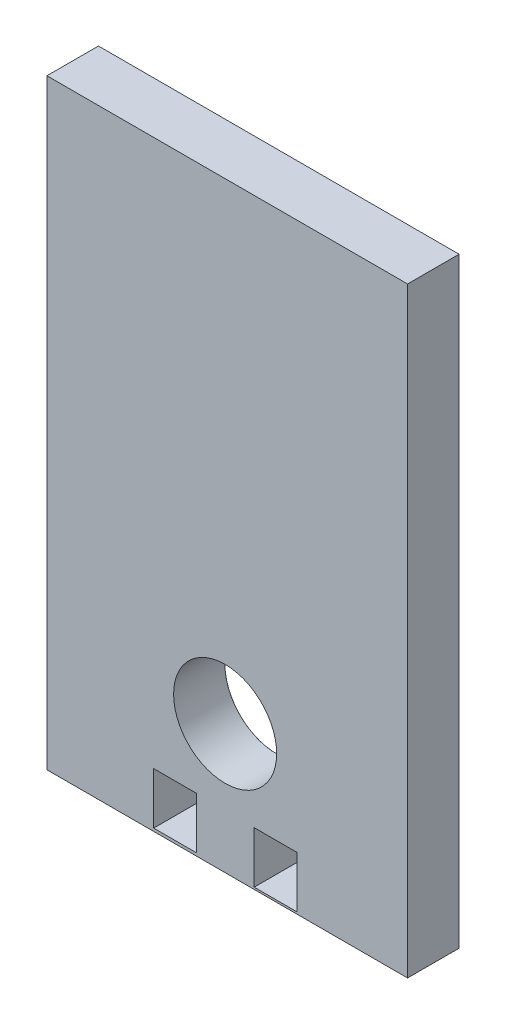
ISO-10303-21;
HEADER;
FILE_DESCRIPTION(('STEP AP214'),'2;1');
FILE_NAME('part.step','',(''),(''),'','','');
FILE_SCHEMA(('AUTOMOTIVE_DESIGN { 1 0 10303 214 1 1 1 1 }'));
ENDSEC;
DATA;
#1=APPLICATION_CONTEXT('core data for automotive mechanical design processes');
#2=APPLICATION_PROTOCOL_DEFINITION('international standard','automotive_design',2000,#1);
#3=PRODUCT_CONTEXT('',#1,'mechanical');
#4=PRODUCT('Part','Part','',(#3));
#5=PRODUCT_RELATED_PRODUCT_CATEGORY('part','',(#4));
#6=PRODUCT_DEFINITION_FORMATION('','',#4);
#7=PRODUCT_DEFINITION_CONTEXT('part definition',#1,'design');
#8=PRODUCT_DEFINITION('design','',#6,#7);
#9=PRODUCT_DEFINITION_SHAPE('','',#8);
#10=(LENGTH_UNIT() NAMED_UNIT(*) SI_UNIT(.MILLI.,.METRE.));
#11=(NAMED_UNIT(*) PLANE_ANGLE_UNIT() SI_UNIT($,.RADIAN.));
#12=(NAMED_UNIT(*) SI_UNIT($,.STERADIAN.) SOLID_ANGLE_UNIT());
#13=UNCERTAINTY_MEASURE_WITH_UNIT(LENGTH_MEASURE(1.E-05),#10,'distance_accuracy_value','');
#14=(GEOMETRIC_REPRESENTATION_CONTEXT(3) GLOBAL_UNCERTAINTY_ASSIGNED_CONTEXT((#13)) GLOBAL_UNIT_ASSIGNED_CONTEXT((#10,
#11,#12)) REPRESENTATION_CONTEXT('',''));
#15=CARTESIAN_POINT('',(0.,0.,0.));
#16=DIRECTION('',(0.,0.,1.));
#17=DIRECTION('',(1.,0.,0.));
#18=AXIS2_PLACEMENT_3D('',#15,#16,#17);
#19=CARTESIAN_POINT('',(0.,0.,6.));
#20=DIRECTION('',(0.,0.,1.));
#21=DIRECTION('',(1.,0.,0.));
#22=AXIS2_PLACEMENT_3D('',#19,#20,#21);
#23=PLANE('',#22);
#24=CARTESIAN_POINT('',(-10.0965774261562,49.8984340550313,6.));
#25=DIRECTION('',(0.,0.,1.));
#26=DIRECTION('',(1.,0.,0.));
#27=AXIS2_PLACEMENT_3D('',#24,#25,#26);
#28=CIRCLE('',#27,5.99999999999999);
#29=CARTESIAN_POINT('',(-4.09657742615621,49.8984340550313,6.));
#30=VERTEX_POINT('',#29);
#31=EDGE_CURVE('E42',#30,#30,#28,.T.);
#32=ORIENTED_EDGE('',*,*,#31,.F.);
#33=EDGE_LOOP('',(#32));
#34=FACE_BOUND('',#33,.T.);
#35=DIRECTION('',(0.,1.,0.));
#36=VECTOR('',#35,1.);
#37=CARTESIAN_POINT('',(11.1502226827763,104.889242878561,6.));
#38=LINE('',#37,#36);
#39=CARTESIAN_POINT('',(11.1502226827763,34.8892428785607,6.));
#40=VERTEX_POINT('',#39);
#41=CARTESIAN_POINT('',(11.1502226827763,104.889242878561,6.));
#42=VERTEX_POINT('',#41);
#43=EDGE_CURVE('E230',#40,#42,#38,.T.);
#44=ORIENTED_EDGE('',*,*,#43,.T.);
#45=DIRECTION('',(-1.,0.,0.));
#46=VECTOR('',#45,1.);
#47=CARTESIAN_POINT('',(-30.8497773172237,104.889242878561,6.));
#48=LINE('',#47,#46);
#49=CARTESIAN_POINT('',(-30.8497773172237,104.889242878561,6.));
#50=VERTEX_POINT('',#49);
#51=EDGE_CURVE('E234',#42,#50,#48,.T.);
#52=ORIENTED_EDGE('',*,*,#51,.T.);
#53=DIRECTION('',(0.,-1.,0.));
#54=VECTOR('',#53,1.);
#55=CARTESIAN_POINT('',(-30.8497773172237,104.889242878561,6.));
#56=LINE('',#55,#54);
#57=CARTESIAN_POINT('',(-30.8497773172237,34.8892428785607,6.));
#58=VERTEX_POINT('',#57);
#59=EDGE_CURVE('E238',#50,#58,#56,.T.);
#60=ORIENTED_EDGE('',*,*,#59,.T.);
#61=DIRECTION('',(1.,0.,0.));
#62=VECTOR('',#61,1.);
#63=CARTESIAN_POINT('',(-30.8497773172237,34.8892428785607,6.));
#64=LINE('',#63,#62);
#65=EDGE_CURVE('E241',#58,#40,#64,.T.);
#66=ORIENTED_EDGE('',*,*,#65,.T.);
#67=EDGE_LOOP('',(#44,#52,#60,#66));
#68=FACE_BOUND('',#67,.T.);
#69=DIRECTION('',(0.,-1.,0.));
#70=VECTOR('',#69,1.);
#71=CARTESIAN_POINT('',(-13.4136289198447,0.,6.));
#72=LINE('',#71,#70);
#73=CARTESIAN_POINT('',(-13.4136289198447,41.2243844001389,6.));
#74=VERTEX_POINT('',#73);
#75=CARTESIAN_POINT('',(-13.4136289198447,35.2243844001389,6.));
#76=VERTEX_POINT('',#75);
#77=EDGE_CURVE('E208',#74,#76,#72,.T.);
#78=ORIENTED_EDGE('',*,*,#77,.T.);
#79=DIRECTION('',(-1.,0.,0.));
#80=VECTOR('',#79,1.);
#81=CARTESIAN_POINT('',(0.,35.2243844001389,6.));
#82=LINE('',#81,#80);
#83=CARTESIAN_POINT('',(-18.4136289198447,35.2243844001389,6.));
#84=VERTEX_POINT('',#83);
#85=EDGE_CURVE('E212',#76,#84,#82,.T.);
#86=ORIENTED_EDGE('',*,*,#85,.T.);
#87=DIRECTION('',(0.,1.,0.));
#88=VECTOR('',#87,1.);
#89=CARTESIAN_POINT('',(-18.4136289198447,0.,6.));
#90=LINE('',#89,#88);
#91=CARTESIAN_POINT('',(-18.4136289198447,41.2243844001389,6.));
#92=VERTEX_POINT('',#91);
#93=EDGE_CURVE('E140',#84,#92,#90,.T.);
#94=ORIENTED_EDGE('',*,*,#93,.T.);
#95=DIRECTION('',(1.,0.,0.));
#96=VECTOR('',#95,1.);
#97=CARTESIAN_POINT('',(0.,41.2243844001389,6.));
#98=LINE('',#97,#96);
#99=EDGE_CURVE('E204',#92,#74,#98,.T.);
#100=ORIENTED_EDGE('',*,*,#99,.T.);
#101=EDGE_LOOP('',(#78,#86,#94,#100));
#102=FACE_BOUND('',#101,.T.);
#103=DIRECTION('',(0.,-1.,0.));
#104=VECTOR('',#103,1.);
#105=CARTESIAN_POINT('',(-1.71130173530675,0.,6.));
#106=LINE('',#105,#104);
#107=CARTESIAN_POINT('',(-1.71130173530675,41.1205277137011,6.));
#108=VERTEX_POINT('',#107);
#109=CARTESIAN_POINT('',(-1.71130173530675,35.1205277137011,6.));
#110=VERTEX_POINT('',#109);
#111=EDGE_CURVE('E224',#108,#110,#106,.T.);
#112=ORIENTED_EDGE('',*,*,#111,.T.);
#113=DIRECTION('',(-1.,0.,0.));
#114=VECTOR('',#113,1.);
#115=CARTESIAN_POINT('',(0.,35.1205277137011,6.));
#116=LINE('',#115,#114);
#117=CARTESIAN_POINT('',(-6.71130173530675,35.1205277137011,6.));
#118=VERTEX_POINT('',#117);
#119=EDGE_CURVE('E136',#110,#118,#116,.T.);
#120=ORIENTED_EDGE('',*,*,#119,.T.);
#121=DIRECTION('',(0.,1.,0.));
#122=VECTOR('',#121,1.);
#123=CARTESIAN_POINT('',(-6.71130173530675,0.,6.));
#124=LINE('',#123,#122);
#125=CARTESIAN_POINT('',(-6.71130173530675,41.1205277137011,6.));
#126=VERTEX_POINT('',#125);
#127=EDGE_CURVE('E216',#118,#126,#124,.T.);
#128=ORIENTED_EDGE('',*,*,#127,.T.);
#129=DIRECTION('',(1.,0.,0.));
#130=VECTOR('',#129,1.);
#131=CARTESIAN_POINT('',(0.,41.1205277137011,6.));
#132=LINE('',#131,#130);
#133=EDGE_CURVE('E220',#126,#108,#132,.T.);
#134=ORIENTED_EDGE('',*,*,#133,.T.);
#135=EDGE_LOOP('',(#112,#120,#128,#134));
#136=FACE_BOUND('',#135,.T.);
#137=ADVANCED_FACE('F38',(#34,#68,#102,#136),#23,.T.);
#138=CARTESIAN_POINT('',(0.,0.,0.));
#139=DIRECTION('',(0.,0.,1.));
#140=DIRECTION('',(1.,0.,0.));
#141=AXIS2_PLACEMENT_3D('',#138,#139,#140);
#142=PLANE('',#141);
#143=CARTESIAN_POINT('',(-10.0965774261562,49.8984340550313,0.));
#144=DIRECTION('',(0.,0.,-1.));
#145=DIRECTION('',(-1.,0.,0.));
#146=AXIS2_PLACEMENT_3D('',#143,#144,#145);
#147=CIRCLE('',#146,6.025);
#148=CARTESIAN_POINT('',(-16.1215774261562,49.8984340550313,0.));
#149=VERTEX_POINT('',#148);
#150=EDGE_CURVE('E356',#149,#149,#147,.T.);
#151=ORIENTED_EDGE('',*,*,#150,.F.);
#152=EDGE_LOOP('',(#151));
#153=FACE_BOUND('',#152,.T.);
#154=DIRECTION('',(1.,0.,0.));
#155=VECTOR('',#154,1.);
#156=CARTESIAN_POINT('',(-13.4136289198447,35.2243844001389,0.));
#157=LINE('',#156,#155);
#158=CARTESIAN_POINT('',(-18.4136289198447,35.2243844001389,0.));
#159=VERTEX_POINT('',#158);
#160=CARTESIAN_POINT('',(-13.4136289198447,35.2243844001389,0.));
#161=VERTEX_POINT('',#160);
#162=EDGE_CURVE('E177',#159,#161,#157,.T.);
#163=ORIENTED_EDGE('',*,*,#162,.T.);
#164=DIRECTION('',(0.,1.,0.));
#165=VECTOR('',#164,1.);
#166=CARTESIAN_POINT('',(-13.4136289198447,41.2243844001389,0.));
#167=LINE('',#166,#165);
#168=CARTESIAN_POINT('',(-13.4136289198447,41.2243844001389,0.));
#169=VERTEX_POINT('',#168);
#170=EDGE_CURVE('E181',#161,#169,#167,.T.);
#171=ORIENTED_EDGE('',*,*,#170,.T.);
#172=DIRECTION('',(-1.,0.,0.));
#173=VECTOR('',#172,1.);
#174=CARTESIAN_POINT('',(-18.4136289198447,41.2243844001389,0.));
#175=LINE('',#174,#173);
#176=CARTESIAN_POINT('',(-18.4136289198447,41.2243844001389,0.));
#177=VERTEX_POINT('',#176);
#178=EDGE_CURVE('E185',#169,#177,#175,.T.);
#179=ORIENTED_EDGE('',*,*,#178,.T.);
#180=DIRECTION('',(0.,-1.,0.));
#181=VECTOR('',#180,1.);
#182=CARTESIAN_POINT('',(-18.4136289198447,35.2243844001389,0.));
#183=LINE('',#182,#181);
#184=EDGE_CURVE('E189',#177,#159,#183,.T.);
#185=ORIENTED_EDGE('',*,*,#184,.T.);
#186=EDGE_LOOP('',(#163,#171,#179,#185));
#187=FACE_BOUND('',#186,.T.);
#188=DIRECTION('',(0.,1.,0.));
#189=VECTOR('',#188,1.);
#190=CARTESIAN_POINT('',(11.1502226827763,104.889242878561,0.));
#191=LINE('',#190,#189);
#192=CARTESIAN_POINT('',(11.1502226827763,34.8892428785607,0.));
#193=VERTEX_POINT('',#192);
#194=CARTESIAN_POINT('',(11.1502226827763,104.889242878561,0.));
#195=VERTEX_POINT('',#194);
#196=EDGE_CURVE('E229',#193,#195,#191,.T.);
#197=ORIENTED_EDGE('',*,*,#196,.F.);
#198=DIRECTION('',(1.,0.,0.));
#199=VECTOR('',#198,1.);
#200=CARTESIAN_POINT('',(-30.8497773172237,34.8892428785607,0.));
#201=LINE('',#200,#199);
#202=CARTESIAN_POINT('',(-30.8497773172237,34.8892428785607,0.));
#203=VERTEX_POINT('',#202);
#204=EDGE_CURVE('E235',#203,#193,#201,.T.);
#205=ORIENTED_EDGE('',*,*,#204,.F.);
#206=DIRECTION('',(0.,-1.,0.));
#207=VECTOR('',#206,1.);
#208=CARTESIAN_POINT('',(-30.8497773172237,104.889242878561,0.));
#209=LINE('',#208,#207);
#210=CARTESIAN_POINT('',(-30.8497773172237,104.889242878561,0.));
#211=VERTEX_POINT('',#210);
#212=EDGE_CURVE('E251',#211,#203,#209,.T.);
#213=ORIENTED_EDGE('',*,*,#212,.F.);
#214=DIRECTION('',(-1.,0.,0.));
#215=VECTOR('',#214,1.);
#216=CARTESIAN_POINT('',(-30.8497773172237,104.889242878561,0.));
#217=LINE('',#216,#215);
#218=EDGE_CURVE('E248',#195,#211,#217,.T.);
#219=ORIENTED_EDGE('',*,*,#218,.F.);
#220=EDGE_LOOP('',(#197,#205,#213,#219));
#221=FACE_BOUND('',#220,.T.);
#222=DIRECTION('',(1.,0.,0.));
#223=VECTOR('',#222,1.);
#224=CARTESIAN_POINT('',(-6.71130173530675,35.1205277137011,0.));
#225=LINE('',#224,#223);
#226=CARTESIAN_POINT('',(-6.71130173530675,35.1205277137011,0.));
#227=VERTEX_POINT('',#226);
#228=CARTESIAN_POINT('',(-1.71130173530675,35.1205277137011,0.));
#229=VERTEX_POINT('',#228);
#230=EDGE_CURVE('E133',#227,#229,#225,.T.);
#231=ORIENTED_EDGE('',*,*,#230,.T.);
#232=DIRECTION('',(0.,1.,0.));
#233=VECTOR('',#232,1.);
#234=CARTESIAN_POINT('',(-1.71130173530675,35.1205277137011,0.));
#235=LINE('',#234,#233);
#236=CARTESIAN_POINT('',(-1.71130173530675,41.1205277137011,0.));
#237=VERTEX_POINT('',#236);
#238=EDGE_CURVE('E144',#229,#237,#235,.T.);
#239=ORIENTED_EDGE('',*,*,#238,.T.);
#240=DIRECTION('',(-1.,0.,0.));
#241=VECTOR('',#240,1.);
#242=CARTESIAN_POINT('',(-1.71130173530675,41.1205277137011,0.));
#243=LINE('',#242,#241);
#244=CARTESIAN_POINT('',(-6.71130173530675,41.1205277137011,0.));
#245=VERTEX_POINT('',#244);
#246=EDGE_CURVE('E151',#237,#245,#243,.T.);
#247=ORIENTED_EDGE('',*,*,#246,.T.);
#248=DIRECTION('',(0.,-1.,0.));
#249=VECTOR('',#248,1.);
#250=CARTESIAN_POINT('',(-6.71130173530675,41.1205277137011,0.));
#251=LINE('',#250,#249);
#252=EDGE_CURVE('E155',#245,#227,#251,.T.);
#253=ORIENTED_EDGE('',*,*,#252,.T.);
#254=EDGE_LOOP('',(#231,#239,#247,#253));
#255=FACE_BOUND('',#254,.T.);
#256=ADVANCED_FACE('F154',(#153,#187,#221,#255),#142,.F.);
#257=CARTESIAN_POINT('',(11.1502226827763,104.889242878561,6.));
#258=DIRECTION('',(-1.,0.,0.));
#259=DIRECTION('',(0.,-1.,0.));
#260=AXIS2_PLACEMENT_3D('',#257,#258,#259);
#261=PLANE('',#260);
#262=ORIENTED_EDGE('',*,*,#196,.T.);
#263=DIRECTION('',(0.,0.,-1.));
#264=VECTOR('',#263,1.);
#265=CARTESIAN_POINT('',(11.1502226827763,104.889242878561,6.));
#266=LINE('',#265,#264);
#267=EDGE_CURVE('E11',#42,#195,#266,.T.);
#268=ORIENTED_EDGE('',*,*,#267,.F.);
#269=ORIENTED_EDGE('',*,*,#43,.F.);
#270=DIRECTION('',(0.,0.,-1.));
#271=VECTOR('',#270,1.);
#272=CARTESIAN_POINT('',(11.1502226827763,34.8892428785607,6.));
#273=LINE('',#272,#271);
#274=EDGE_CURVE('E244',#40,#193,#273,.T.);
#275=ORIENTED_EDGE('',*,*,#274,.T.);
#276=EDGE_LOOP('',(#262,#268,#269,#275));
#277=FACE_BOUND('',#276,.T.);
#278=ADVANCED_FACE('F40',(#277),#261,.F.);
#279=CARTESIAN_POINT('',(-30.8497773172237,104.889242878561,6.));
#280=DIRECTION('',(0.,-1.,0.));
#281=DIRECTION('',(0.,0.,-1.));
#282=AXIS2_PLACEMENT_3D('',#279,#280,#281);
#283=PLANE('',#282);
#284=ORIENTED_EDGE('',*,*,#218,.T.);
#285=DIRECTION('',(0.,0.,-1.));
#286=VECTOR('',#285,1.);
#287=CARTESIAN_POINT('',(-30.8497773172237,104.889242878561,6.));
#288=LINE('',#287,#286);
#289=EDGE_CURVE('E48',#50,#211,#288,.T.);
#290=ORIENTED_EDGE('',*,*,#289,.F.);
#291=ORIENTED_EDGE('',*,*,#51,.F.);
#292=ORIENTED_EDGE('',*,*,#267,.T.);
#293=EDGE_LOOP('',(#284,#290,#291,#292));
#294=FACE_BOUND('',#293,.T.);
#295=ADVANCED_FACE('F284',(#294),#283,.F.);
#296=CARTESIAN_POINT('',(-30.8497773172237,104.889242878561,6.));
#297=DIRECTION('',(1.,0.,0.));
#298=DIRECTION('',(0.,1.,0.));
#299=AXIS2_PLACEMENT_3D('',#296,#297,#298);
#300=PLANE('',#299);
#301=ORIENTED_EDGE('',*,*,#212,.T.);
#302=DIRECTION('',(0.,0.,-1.));
#303=VECTOR('',#302,1.);
#304=CARTESIAN_POINT('',(-30.8497773172237,34.8892428785607,6.));
#305=LINE('',#304,#303);
#306=EDGE_CURVE('E259',#58,#203,#305,.T.);
#307=ORIENTED_EDGE('',*,*,#306,.F.);
#308=ORIENTED_EDGE('',*,*,#59,.F.);
#309=ORIENTED_EDGE('',*,*,#289,.T.);
#310=EDGE_LOOP('',(#301,#307,#308,#309));
#311=FACE_BOUND('',#310,.T.);
#312=ADVANCED_FACE('F269',(#311),#300,.F.);
#313=CARTESIAN_POINT('',(-30.8497773172237,34.8892428785607,6.));
#314=DIRECTION('',(0.,1.,0.));
#315=DIRECTION('',(0.,0.,1.));
#316=AXIS2_PLACEMENT_3D('',#313,#314,#315);
#317=PLANE('',#316);
#318=ORIENTED_EDGE('',*,*,#204,.T.);
#319=ORIENTED_EDGE('',*,*,#274,.F.);
#320=ORIENTED_EDGE('',*,*,#65,.F.);
#321=ORIENTED_EDGE('',*,*,#306,.T.);
#322=EDGE_LOOP('',(#318,#319,#320,#321));
#323=FACE_BOUND('',#322,.T.);
#324=ADVANCED_FACE('F277',(#323),#317,.F.);
#325=CARTESIAN_POINT('',(-13.4136289198447,35.2243844001389,9.));
#326=DIRECTION('',(0.,1.,0.));
#327=DIRECTION('',(0.,0.,1.));
#328=AXIS2_PLACEMENT_3D('',#325,#326,#327);
#329=PLANE('',#328);
#330=DIRECTION('',(0.,0.,-1.));
#331=VECTOR('',#330,1.);
#332=CARTESIAN_POINT('',(-13.4136289198447,35.2243844001389,9.));
#333=LINE('',#332,#331);
#334=EDGE_CURVE('E157',#76,#161,#333,.T.);
#335=ORIENTED_EDGE('',*,*,#334,.T.);
#336=ORIENTED_EDGE('',*,*,#162,.F.);
#337=DIRECTION('',(0.,0.,-1.));
#338=VECTOR('',#337,1.);
#339=CARTESIAN_POINT('',(-18.4136289198447,35.2243844001389,9.));
#340=LINE('',#339,#338);
#341=EDGE_CURVE('E193',#84,#159,#340,.T.);
#342=ORIENTED_EDGE('',*,*,#341,.F.);
#343=ORIENTED_EDGE('',*,*,#85,.F.);
#344=EDGE_LOOP('',(#335,#336,#342,#343));
#345=FACE_BOUND('',#344,.T.);
#346=ADVANCED_FACE('F301',(#345),#329,.T.);
#347=CARTESIAN_POINT('',(-13.4136289198447,41.2243844001389,9.));
#348=DIRECTION('',(-1.,0.,0.));
#349=DIRECTION('',(0.,0.,1.));
#350=AXIS2_PLACEMENT_3D('',#347,#348,#349);
#351=PLANE('',#350);
#352=DIRECTION('',(0.,0.,-1.));
#353=VECTOR('',#352,1.);
#354=CARTESIAN_POINT('',(-13.4136289198447,41.2243844001389,9.));
#355=LINE('',#354,#353);
#356=EDGE_CURVE('E160',#74,#169,#355,.T.);
#357=ORIENTED_EDGE('',*,*,#356,.T.);
#358=ORIENTED_EDGE('',*,*,#170,.F.);
#359=ORIENTED_EDGE('',*,*,#334,.F.);
#360=ORIENTED_EDGE('',*,*,#77,.F.);
#361=EDGE_LOOP('',(#357,#358,#359,#360));
#362=FACE_BOUND('',#361,.T.);
#363=ADVANCED_FACE('F308',(#362),#351,.T.);
#364=CARTESIAN_POINT('',(-18.4136289198447,41.2243844001389,9.));
#365=DIRECTION('',(0.,-1.,0.));
#366=DIRECTION('',(0.,0.,-1.));
#367=AXIS2_PLACEMENT_3D('',#364,#365,#366);
#368=PLANE('',#367);
#369=DIRECTION('',(0.,0.,-1.));
#370=VECTOR('',#369,1.);
#371=CARTESIAN_POINT('',(-18.4136289198447,41.2243844001389,9.));
#372=LINE('',#371,#370);
#373=EDGE_CURVE('E63',#92,#177,#372,.T.);
#374=ORIENTED_EDGE('',*,*,#373,.T.);
#375=ORIENTED_EDGE('',*,*,#178,.F.);
#376=ORIENTED_EDGE('',*,*,#356,.F.);
#377=ORIENTED_EDGE('',*,*,#99,.F.);
#378=EDGE_LOOP('',(#374,#375,#376,#377));
#379=FACE_BOUND('',#378,.T.);
#380=ADVANCED_FACE('F313',(#379),#368,.T.);
#381=CARTESIAN_POINT('',(-18.4136289198447,35.2243844001389,9.));
#382=DIRECTION('',(1.,0.,0.));
#383=DIRECTION('',(0.,0.,-1.));
#384=AXIS2_PLACEMENT_3D('',#381,#382,#383);
#385=PLANE('',#384);
#386=ORIENTED_EDGE('',*,*,#341,.T.);
#387=ORIENTED_EDGE('',*,*,#184,.F.);
#388=ORIENTED_EDGE('',*,*,#373,.F.);
#389=ORIENTED_EDGE('',*,*,#93,.F.);
#390=EDGE_LOOP('',(#386,#387,#388,#389));
#391=FACE_BOUND('',#390,.T.);
#392=ADVANCED_FACE('F321',(#391),#385,.T.);
#393=CARTESIAN_POINT('',(-6.71130173530675,35.1205277137011,9.));
#394=DIRECTION('',(0.,1.,0.));
#395=DIRECTION('',(0.,0.,1.));
#396=AXIS2_PLACEMENT_3D('',#393,#394,#395);
#397=PLANE('',#396);
#398=DIRECTION('',(0.,0.,-1.));
#399=VECTOR('',#398,1.);
#400=CARTESIAN_POINT('',(-1.71130173530675,35.1205277137011,9.));
#401=LINE('',#400,#399);
#402=EDGE_CURVE('E128',#110,#229,#401,.T.);
#403=ORIENTED_EDGE('',*,*,#402,.T.);
#404=ORIENTED_EDGE('',*,*,#230,.F.);
#405=DIRECTION('',(0.,0.,-1.));
#406=VECTOR('',#405,1.);
#407=CARTESIAN_POINT('',(-6.71130173530675,35.1205277137011,9.));
#408=LINE('',#407,#406);
#409=EDGE_CURVE('E170',#118,#227,#408,.T.);
#410=ORIENTED_EDGE('',*,*,#409,.F.);
#411=ORIENTED_EDGE('',*,*,#119,.F.);
#412=EDGE_LOOP('',(#403,#404,#410,#411));
#413=FACE_BOUND('',#412,.T.);
#414=ADVANCED_FACE('F130',(#413),#397,.T.);
#415=CARTESIAN_POINT('',(-1.71130173530675,35.1205277137011,9.));
#416=DIRECTION('',(-1.,0.,0.));
#417=DIRECTION('',(0.,0.,1.));
#418=AXIS2_PLACEMENT_3D('',#415,#416,#417);
#419=PLANE('',#418);
#420=DIRECTION('',(0.,0.,-1.));
#421=VECTOR('',#420,1.);
#422=CARTESIAN_POINT('',(-1.71130173530675,41.1205277137011,9.));
#423=LINE('',#422,#421);
#424=EDGE_CURVE('E141',#108,#237,#423,.T.);
#425=ORIENTED_EDGE('',*,*,#424,.T.);
#426=ORIENTED_EDGE('',*,*,#238,.F.);
#427=ORIENTED_EDGE('',*,*,#402,.F.);
#428=ORIENTED_EDGE('',*,*,#111,.F.);
#429=EDGE_LOOP('',(#425,#426,#427,#428));
#430=FACE_BOUND('',#429,.T.);
#431=ADVANCED_FACE('F145',(#430),#419,.T.);
#432=CARTESIAN_POINT('',(-1.71130173530675,41.1205277137011,9.));
#433=DIRECTION('',(0.,-1.,0.));
#434=DIRECTION('',(0.,0.,-1.));
#435=AXIS2_PLACEMENT_3D('',#432,#433,#434);
#436=PLANE('',#435);
#437=DIRECTION('',(0.,0.,-1.));
#438=VECTOR('',#437,1.);
#439=CARTESIAN_POINT('',(-6.71130173530675,41.1205277137011,9.));
#440=LINE('',#439,#438);
#441=EDGE_CURVE('E55',#126,#245,#440,.T.);
#442=ORIENTED_EDGE('',*,*,#441,.T.);
#443=ORIENTED_EDGE('',*,*,#246,.F.);
#444=ORIENTED_EDGE('',*,*,#424,.F.);
#445=ORIENTED_EDGE('',*,*,#133,.F.);
#446=EDGE_LOOP('',(#442,#443,#444,#445));
#447=FACE_BOUND('',#446,.T.);
#448=ADVANCED_FACE('F335',(#447),#436,.T.);
#449=CARTESIAN_POINT('',(-6.71130173530675,41.1205277137011,9.));
#450=DIRECTION('',(1.,0.,0.));
#451=DIRECTION('',(0.,0.,-1.));
#452=AXIS2_PLACEMENT_3D('',#449,#450,#451);
#453=PLANE('',#452);
#454=ORIENTED_EDGE('',*,*,#409,.T.);
#455=ORIENTED_EDGE('',*,*,#252,.F.);
#456=ORIENTED_EDGE('',*,*,#441,.F.);
#457=ORIENTED_EDGE('',*,*,#127,.F.);
#458=EDGE_LOOP('',(#454,#455,#456,#457));
#459=FACE_BOUND('',#458,.T.);
#460=ADVANCED_FACE('F338',(#459),#453,.T.);
#461=CARTESIAN_POINT('',(-10.0965774261562,49.8984340550313,0.));
#462=DIRECTION('',(0.,0.,-1.));
#463=DIRECTION('',(-1.,0.,0.));
#464=AXIS2_PLACEMENT_3D('',#461,#462,#463);
#465=CYLINDRICAL_SURFACE('',#464,5.99999999999999);
#466=ORIENTED_EDGE('',*,*,#31,.T.);
#467=EDGE_LOOP('',(#466));
#468=FACE_BOUND('',#467,.T.);
#469=CARTESIAN_POINT('',(-10.0965774261562,49.8984340550313,0.0250000000000111));
#470=DIRECTION('',(0.,0.,-1.));
#471=DIRECTION('',(-1.,0.,0.));
#472=AXIS2_PLACEMENT_3D('',#469,#470,#471);
#473=CIRCLE('',#472,5.99999999999999);
#474=CARTESIAN_POINT('',(-16.0965774261562,49.8984340550313,0.0250000000000111));
#475=VERTEX_POINT('',#474);
#476=EDGE_CURVE('E163',#475,#475,#473,.T.);
#477=ORIENTED_EDGE('',*,*,#476,.T.);
#478=EDGE_LOOP('',(#477));
#479=FACE_BOUND('',#478,.T.);
#480=ADVANCED_FACE('F342',(#468,#479),#465,.F.);
#481=CARTESIAN_POINT('',(-10.0965774261562,49.8984340550313,0.));
#482=DIRECTION('',(0.,0.,-1.));
#483=DIRECTION('',(-1.,0.,0.));
#484=AXIS2_PLACEMENT_3D('',#481,#482,#483);
#485=CONICAL_SURFACE('',#484,6.025,0.785398163397362);
#486=ORIENTED_EDGE('',*,*,#476,.F.);
#487=EDGE_LOOP('',(#486));
#488=FACE_BOUND('',#487,.T.);
#489=ORIENTED_EDGE('',*,*,#150,.T.);
#490=EDGE_LOOP('',(#489));
#491=FACE_BOUND('',#490,.T.);
#492=ADVANCED_FACE('F345',(#488,#491),#485,.F.);
#493=CLOSED_SHELL('',(#137,#256,#278,#295,#312,#324,#346,#363,#380,#392,#414,#431,#448,#460,
#480,#492));
#494=MANIFOLD_SOLID_BREP('B2',#493);
#495=ADVANCED_BREP_SHAPE_REPRESENTATION('',(#18,#494),#14);
#496=SHAPE_DEFINITION_REPRESENTATION(#9,#495);
ENDSEC;
END-ISO-10303-21;
